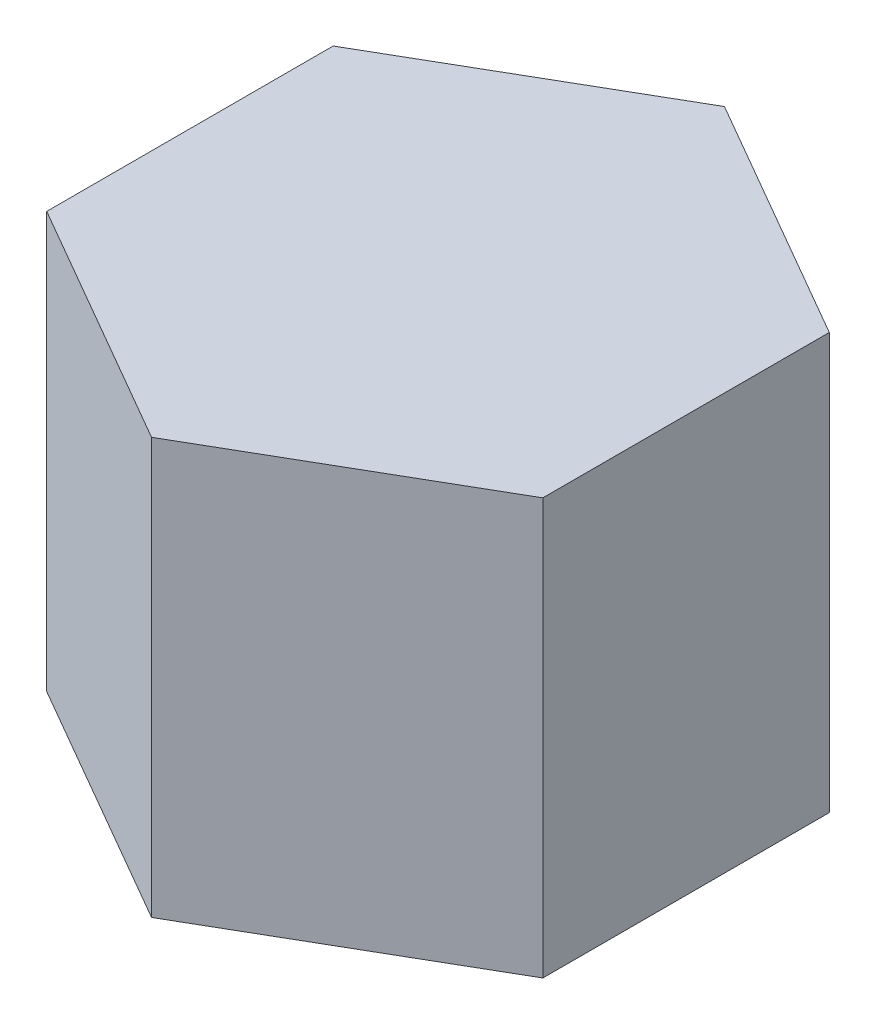
ISO-10303-21;
HEADER;
FILE_DESCRIPTION(('STEP AP214'),'2;1');
FILE_NAME('part.step','',(''),(''),'','','');
FILE_SCHEMA(('AUTOMOTIVE_DESIGN { 1 0 10303 214 1 1 1 1 }'));
ENDSEC;
DATA;
#1=APPLICATION_CONTEXT('core data for automotive mechanical design processes');
#2=APPLICATION_PROTOCOL_DEFINITION('international standard','automotive_design',2000,#1);
#3=PRODUCT_CONTEXT('',#1,'mechanical');
#4=PRODUCT('Part','Part','',(#3));
#5=PRODUCT_RELATED_PRODUCT_CATEGORY('part','',(#4));
#6=PRODUCT_DEFINITION_FORMATION('','',#4);
#7=PRODUCT_DEFINITION_CONTEXT('part definition',#1,'design');
#8=PRODUCT_DEFINITION('design','',#6,#7);
#9=PRODUCT_DEFINITION_SHAPE('','',#8);
#10=(LENGTH_UNIT() NAMED_UNIT(*) SI_UNIT(.MILLI.,.METRE.));
#11=(NAMED_UNIT(*) PLANE_ANGLE_UNIT() SI_UNIT($,.RADIAN.));
#12=(NAMED_UNIT(*) SI_UNIT($,.STERADIAN.) SOLID_ANGLE_UNIT());
#13=UNCERTAINTY_MEASURE_WITH_UNIT(LENGTH_MEASURE(1.E-05),#10,'distance_accuracy_value','');
#14=(GEOMETRIC_REPRESENTATION_CONTEXT(3) GLOBAL_UNCERTAINTY_ASSIGNED_CONTEXT((#13)) GLOBAL_UNIT_ASSIGNED_CONTEXT((#10,
#11,#12)) REPRESENTATION_CONTEXT('',''));
#15=CARTESIAN_POINT('',(0.,0.,0.));
#16=DIRECTION('',(0.,0.,1.));
#17=DIRECTION('',(1.,0.,0.));
#18=AXIS2_PLACEMENT_3D('',#15,#16,#17);
#19=CARTESIAN_POINT('',(205.642660308706,-148.537700895744,294.971072835632));
#20=DIRECTION('',(-0.499999999999943,0.,-0.866025403784472));
#21=DIRECTION('',(-0.866025403784472,0.,0.499999999999943));
#22=AXIS2_PLACEMENT_3D('',#19,#20,#21);
#23=PLANE('',#22);
#24=CARTESIAN_POINT('',(205.339551417381,-149.045793579175,295.146072835632));
#25=DIRECTION('',(0.866025403784471,0.,-0.499999999999943));
#26=VECTOR('',#25,1.);
#27=LINE('',#24,#26);
#28=CARTESIAN_POINT('',(205.339551417382,-149.045793579175,295.146072835632));
#29=VERTEX_POINT('',#28);
#30=CARTESIAN_POINT('',(205.642660308706,-149.045793579175,294.971072835632));
#31=VERTEX_POINT('',#30);
#32=EDGE_CURVE('E170',#29,#31,#27,.T.);
#33=ORIENTED_EDGE('',*,*,#32,.T.);
#34=CARTESIAN_POINT('',(205.642660308706,-148.537700895744,294.971072835632));
#35=DIRECTION('',(0.,-1.,0.));
#36=VECTOR('',#35,1.);
#37=LINE('',#34,#36);
#38=CARTESIAN_POINT('',(205.642660308706,-148.537700895744,294.971072835632));
#39=VERTEX_POINT('',#38);
#40=EDGE_CURVE('E35',#39,#31,#37,.T.);
#41=ORIENTED_EDGE('',*,*,#40,.F.);
#42=CARTESIAN_POINT('',(205.339551417381,-148.537700895744,295.146072835632));
#43=DIRECTION('',(0.866025403784471,0.,-0.499999999999943));
#44=VECTOR('',#43,1.);
#45=LINE('',#42,#44);
#46=CARTESIAN_POINT('',(205.339551417382,-148.537700895744,295.146072835632));
#47=VERTEX_POINT('',#46);
#48=EDGE_CURVE('E159',#47,#39,#45,.T.);
#49=ORIENTED_EDGE('',*,*,#48,.F.);
#50=CARTESIAN_POINT('',(205.339551417381,-148.537700895744,295.146072835632));
#51=DIRECTION('',(0.,-1.,0.));
#52=VECTOR('',#51,1.);
#53=LINE('',#50,#52);
#54=EDGE_CURVE('E10',#47,#29,#53,.T.);
#55=ORIENTED_EDGE('',*,*,#54,.T.);
#56=EDGE_LOOP('',(#33,#41,#49,#55));
#57=FACE_BOUND('',#56,.T.);
#58=ADVANCED_FACE('F16',(#57),#23,.F.);
#59=CARTESIAN_POINT('',(205.339551417382,-148.537700895744,295.146072835632));
#60=DIRECTION('',(0.500000000000062,0.,-0.866025403784403));
#61=DIRECTION('',(-0.866025403784403,0.,-0.500000000000062));
#62=AXIS2_PLACEMENT_3D('',#59,#60,#61);
#63=PLANE('',#62);
#64=CARTESIAN_POINT('',(205.036442526057,-149.045793579175,294.971072835632));
#65=DIRECTION('',(0.866025403784403,0.,0.500000000000062));
#66=VECTOR('',#65,1.);
#67=LINE('',#64,#66);
#68=CARTESIAN_POINT('',(205.036442526057,-149.045793579175,294.971072835632));
#69=VERTEX_POINT('',#68);
#70=EDGE_CURVE('E167',#69,#29,#67,.T.);
#71=ORIENTED_EDGE('',*,*,#70,.T.);
#72=ORIENTED_EDGE('',*,*,#54,.F.);
#73=CARTESIAN_POINT('',(205.036442526057,-148.537700895744,294.971072835632));
#74=DIRECTION('',(0.866025403784403,0.,0.500000000000062));
#75=VECTOR('',#74,1.);
#76=LINE('',#73,#75);
#77=CARTESIAN_POINT('',(205.036442526057,-148.537700895744,294.971072835632));
#78=VERTEX_POINT('',#77);
#79=EDGE_CURVE('E156',#78,#47,#76,.T.);
#80=ORIENTED_EDGE('',*,*,#79,.F.);
#81=CARTESIAN_POINT('',(205.036442526057,-148.537700895744,294.971072835632));
#82=DIRECTION('',(0.,-1.,0.));
#83=VECTOR('',#82,1.);
#84=LINE('',#81,#83);
#85=EDGE_CURVE('E27',#78,#69,#84,.T.);
#86=ORIENTED_EDGE('',*,*,#85,.T.);
#87=EDGE_LOOP('',(#71,#72,#80,#86));
#88=FACE_BOUND('',#87,.T.);
#89=ADVANCED_FACE('F189',(#88),#63,.F.);
#90=CARTESIAN_POINT('',(205.036442526057,-148.537700895744,290.831971220494));
#91=DIRECTION('',(1.,0.,0.));
#92=DIRECTION('',(0.,1.,0.));
#93=AXIS2_PLACEMENT_3D('',#90,#91,#92);
#94=PLANE('',#93);
#95=CARTESIAN_POINT('',(205.036442526057,-149.045793579175,294.621072835632));
#96=DIRECTION('',(0.,0.,1.));
#97=VECTOR('',#96,1.);
#98=LINE('',#95,#97);
#99=CARTESIAN_POINT('',(205.036442526057,-149.045793579175,294.621072835632));
#100=VERTEX_POINT('',#99);
#101=EDGE_CURVE('E163',#100,#69,#98,.T.);
#102=ORIENTED_EDGE('',*,*,#101,.T.);
#103=ORIENTED_EDGE('',*,*,#85,.F.);
#104=CARTESIAN_POINT('',(205.036442526057,-148.537700895744,294.621072835632));
#105=DIRECTION('',(0.,0.,1.));
#106=VECTOR('',#105,1.);
#107=LINE('',#104,#106);
#108=CARTESIAN_POINT('',(205.036442526057,-148.537700895744,294.621072835632));
#109=VERTEX_POINT('',#108);
#110=EDGE_CURVE('E106',#109,#78,#107,.T.);
#111=ORIENTED_EDGE('',*,*,#110,.F.);
#112=CARTESIAN_POINT('',(205.036442526057,-148.537700895744,294.621072835632));
#113=DIRECTION('',(0.,-1.,0.));
#114=VECTOR('',#113,1.);
#115=LINE('',#112,#114);
#116=EDGE_CURVE('E94',#109,#100,#115,.T.);
#117=ORIENTED_EDGE('',*,*,#116,.T.);
#118=EDGE_LOOP('',(#102,#103,#111,#117));
#119=FACE_BOUND('',#118,.T.);
#120=ADVANCED_FACE('F198',(#119),#94,.F.);
#121=CARTESIAN_POINT('',(205.036442526057,-148.537700895744,294.621072835632));
#122=DIRECTION('',(0.499999999999978,0.,0.866025403784452));
#123=DIRECTION('',(0.866025403784452,0.,-0.499999999999978));
#124=AXIS2_PLACEMENT_3D('',#121,#122,#123);
#125=PLANE('',#124);
#126=CARTESIAN_POINT('',(205.339551417382,-149.045793579175,294.446072835632));
#127=DIRECTION('',(-0.866025403784452,0.,0.499999999999978));
#128=VECTOR('',#127,1.);
#129=LINE('',#126,#128);
#130=CARTESIAN_POINT('',(205.339551417382,-149.045793579175,294.446072835632));
#131=VERTEX_POINT('',#130);
#132=EDGE_CURVE('E162',#131,#100,#129,.T.);
#133=ORIENTED_EDGE('',*,*,#132,.T.);
#134=ORIENTED_EDGE('',*,*,#116,.F.);
#135=CARTESIAN_POINT('',(205.339551417382,-148.537700895744,294.446072835632));
#136=DIRECTION('',(-0.866025403784452,0.,0.499999999999978));
#137=VECTOR('',#136,1.);
#138=LINE('',#135,#137);
#139=CARTESIAN_POINT('',(205.339551417382,-148.537700895744,294.446072835632));
#140=VERTEX_POINT('',#139);
#141=EDGE_CURVE('E98',#140,#109,#138,.T.);
#142=ORIENTED_EDGE('',*,*,#141,.F.);
#143=CARTESIAN_POINT('',(205.339551417382,-148.537700895744,294.446072835632));
#144=DIRECTION('',(0.,-1.,0.));
#145=VECTOR('',#144,1.);
#146=LINE('',#143,#145);
#147=EDGE_CURVE('E79',#140,#131,#146,.T.);
#148=ORIENTED_EDGE('',*,*,#147,.T.);
#149=EDGE_LOOP('',(#133,#134,#142,#148));
#150=FACE_BOUND('',#149,.T.);
#151=ADVANCED_FACE('F100',(#150),#125,.F.);
#152=CARTESIAN_POINT('',(205.339551417382,-148.537700895744,294.446072835632));
#153=DIRECTION('',(-0.500000000000012,0.,0.866025403784432));
#154=DIRECTION('',(0.866025403784432,0.,0.500000000000012));
#155=AXIS2_PLACEMENT_3D('',#152,#153,#154);
#156=PLANE('',#155);
#157=CARTESIAN_POINT('',(205.642660308706,-149.045793579175,294.621072835632));
#158=DIRECTION('',(-0.866025403784432,0.,-0.500000000000012));
#159=VECTOR('',#158,1.);
#160=LINE('',#157,#159);
#161=CARTESIAN_POINT('',(205.642660308706,-149.045793579175,294.621072835632));
#162=VERTEX_POINT('',#161);
#163=EDGE_CURVE('E88',#162,#131,#160,.T.);
#164=ORIENTED_EDGE('',*,*,#163,.T.);
#165=ORIENTED_EDGE('',*,*,#147,.F.);
#166=CARTESIAN_POINT('',(205.642660308706,-148.537700895744,294.621072835632));
#167=DIRECTION('',(-0.866025403784432,0.,-0.500000000000012));
#168=VECTOR('',#167,1.);
#169=LINE('',#166,#168);
#170=CARTESIAN_POINT('',(205.642660308706,-148.537700895744,294.621072835632));
#171=VERTEX_POINT('',#170);
#172=EDGE_CURVE('E84',#171,#140,#169,.T.);
#173=ORIENTED_EDGE('',*,*,#172,.F.);
#174=CARTESIAN_POINT('',(205.642660308706,-148.537700895744,294.621072835632));
#175=DIRECTION('',(0.,-1.,0.));
#176=VECTOR('',#175,1.);
#177=LINE('',#174,#176);
#178=EDGE_CURVE('E58',#171,#162,#177,.T.);
#179=ORIENTED_EDGE('',*,*,#178,.T.);
#180=EDGE_LOOP('',(#164,#165,#173,#179));
#181=FACE_BOUND('',#180,.T.);
#182=ADVANCED_FACE('F82',(#181),#156,.F.);
#183=CARTESIAN_POINT('',(205.642660308706,-148.537700895744,290.831971220494));
#184=DIRECTION('',(-1.,0.,0.));
#185=DIRECTION('',(0.,-1.,0.));
#186=AXIS2_PLACEMENT_3D('',#183,#184,#185);
#187=PLANE('',#186);
#188=CARTESIAN_POINT('',(205.642660308706,-149.045793579175,294.971072835632));
#189=DIRECTION('',(0.,0.,-1.));
#190=VECTOR('',#189,1.);
#191=LINE('',#188,#190);
#192=EDGE_CURVE('E160',#31,#162,#191,.T.);
#193=ORIENTED_EDGE('',*,*,#192,.T.);
#194=ORIENTED_EDGE('',*,*,#178,.F.);
#195=CARTESIAN_POINT('',(205.642660308706,-148.537700895744,294.971072835632));
#196=DIRECTION('',(0.,0.,-1.));
#197=VECTOR('',#196,1.);
#198=LINE('',#195,#197);
#199=EDGE_CURVE('E112',#39,#171,#198,.T.);
#200=ORIENTED_EDGE('',*,*,#199,.F.);
#201=ORIENTED_EDGE('',*,*,#40,.T.);
#202=EDGE_LOOP('',(#193,#194,#200,#201));
#203=FACE_BOUND('',#202,.T.);
#204=ADVANCED_FACE('F131',(#203),#187,.F.);
#205=CARTESIAN_POINT('',(206.339551417382,-148.537700895744,290.831971220494));
#206=DIRECTION('',(0.,-1.,0.));
#207=DIRECTION('',(1.,0.,0.));
#208=AXIS2_PLACEMENT_3D('',#205,#206,#207);
#209=PLANE('',#208);
#210=ORIENTED_EDGE('',*,*,#48,.T.);
#211=ORIENTED_EDGE('',*,*,#199,.T.);
#212=ORIENTED_EDGE('',*,*,#172,.T.);
#213=ORIENTED_EDGE('',*,*,#141,.T.);
#214=ORIENTED_EDGE('',*,*,#110,.T.);
#215=ORIENTED_EDGE('',*,*,#79,.T.);
#216=EDGE_LOOP('',(#210,#211,#212,#213,#214,#215));
#217=FACE_BOUND('',#216,.T.);
#218=ADVANCED_FACE('F111',(#217),#209,.F.);
#219=CARTESIAN_POINT('',(206.339551417382,-149.045793579175,290.831971220494));
#220=DIRECTION('',(0.,-1.,0.));
#221=DIRECTION('',(1.,0.,0.));
#222=AXIS2_PLACEMENT_3D('',#219,#220,#221);
#223=PLANE('',#222);
#224=ORIENTED_EDGE('',*,*,#32,.F.);
#225=ORIENTED_EDGE('',*,*,#70,.F.);
#226=ORIENTED_EDGE('',*,*,#101,.F.);
#227=ORIENTED_EDGE('',*,*,#132,.F.);
#228=ORIENTED_EDGE('',*,*,#163,.F.);
#229=ORIENTED_EDGE('',*,*,#192,.F.);
#230=EDGE_LOOP('',(#224,#225,#226,#227,#228,#229));
#231=FACE_BOUND('',#230,.T.);
#232=ADVANCED_FACE('F130',(#231),#223,.T.);
#233=CLOSED_SHELL('',(#58,#89,#120,#151,#182,#204,#218,#232));
#234=MANIFOLD_SOLID_BREP('B1',#233);
#235=ADVANCED_BREP_SHAPE_REPRESENTATION('',(#18,#234),#14);
#236=SHAPE_DEFINITION_REPRESENTATION(#9,#235);
ENDSEC;
END-ISO-10303-21;
